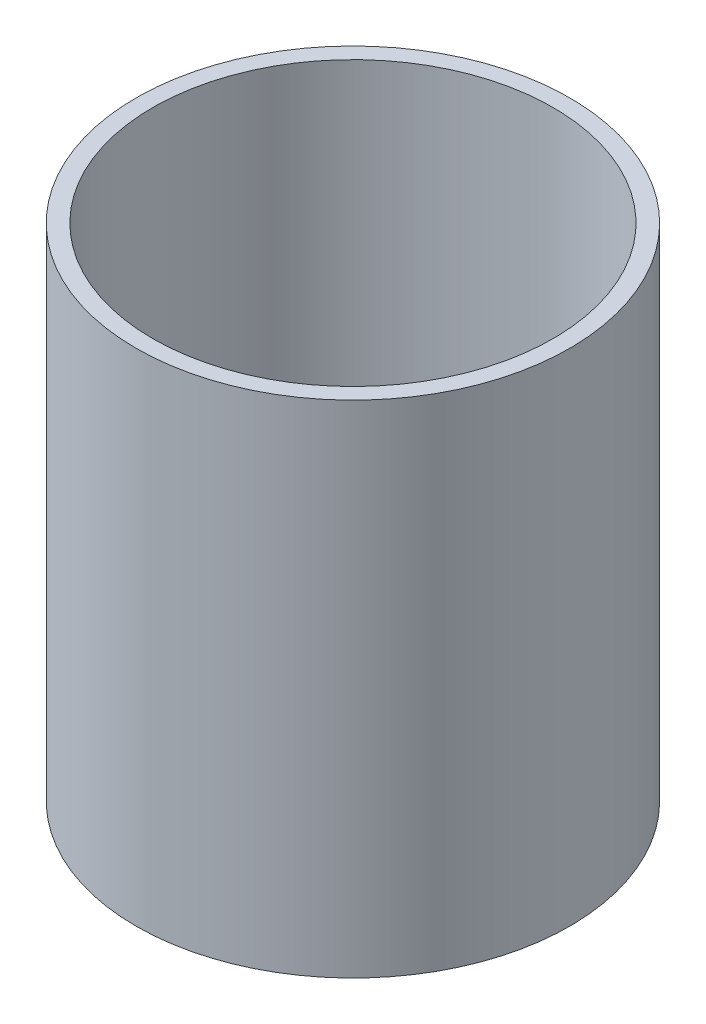
ISO-10303-21;
HEADER;
FILE_DESCRIPTION(('STEP AP214'),'2;1');
FILE_NAME('part.step','',(''),(''),'','','');
FILE_SCHEMA(('AUTOMOTIVE_DESIGN { 1 0 10303 214 1 1 1 1 }'));
ENDSEC;
DATA;
#1=APPLICATION_CONTEXT('core data for automotive mechanical design processes');
#2=APPLICATION_PROTOCOL_DEFINITION('international standard','automotive_design',2000,#1);
#3=PRODUCT_CONTEXT('',#1,'mechanical');
#4=PRODUCT('Part','Part','',(#3));
#5=PRODUCT_RELATED_PRODUCT_CATEGORY('part','',(#4));
#6=PRODUCT_DEFINITION_FORMATION('','',#4);
#7=PRODUCT_DEFINITION_CONTEXT('part definition',#1,'design');
#8=PRODUCT_DEFINITION('design','',#6,#7);
#9=PRODUCT_DEFINITION_SHAPE('','',#8);
#10=(LENGTH_UNIT() NAMED_UNIT(*) SI_UNIT(.MILLI.,.METRE.));
#11=(NAMED_UNIT(*) PLANE_ANGLE_UNIT() SI_UNIT($,.RADIAN.));
#12=(NAMED_UNIT(*) SI_UNIT($,.STERADIAN.) SOLID_ANGLE_UNIT());
#13=UNCERTAINTY_MEASURE_WITH_UNIT(LENGTH_MEASURE(1.E-05),#10,'distance_accuracy_value','');
#14=(GEOMETRIC_REPRESENTATION_CONTEXT(3) GLOBAL_UNCERTAINTY_ASSIGNED_CONTEXT((#13)) GLOBAL_UNIT_ASSIGNED_CONTEXT((#10,
#11,#12)) REPRESENTATION_CONTEXT('',''));
#15=CARTESIAN_POINT('',(0.,0.,0.));
#16=DIRECTION('',(0.,0.,1.));
#17=DIRECTION('',(1.,0.,0.));
#18=AXIS2_PLACEMENT_3D('',#15,#16,#17);
#19=CARTESIAN_POINT('',(0.,70.,0.));
#20=DIRECTION('',(0.,-1.,0.));
#21=DIRECTION('',(0.,0.,-1.));
#22=AXIS2_PLACEMENT_3D('',#19,#20,#21);
#23=CYLINDRICAL_SURFACE('',#22,26.);
#24=CARTESIAN_POINT('',(0.,0.,0.));
#25=DIRECTION('',(0.,1.,0.));
#26=DIRECTION('',(0.,0.,1.));
#27=AXIS2_PLACEMENT_3D('',#24,#25,#26);
#28=CIRCLE('',#27,26.);
#29=CARTESIAN_POINT('',(0.,0.,26.));
#30=VERTEX_POINT('',#29);
#31=EDGE_CURVE('E10',#30,#30,#28,.T.);
#32=ORIENTED_EDGE('',*,*,#31,.T.);
#33=EDGE_LOOP('',(#32));
#34=FACE_BOUND('',#33,.T.);
#35=CARTESIAN_POINT('',(0.,60.,0.));
#36=DIRECTION('',(0.,1.,0.));
#37=DIRECTION('',(0.,0.,1.));
#38=AXIS2_PLACEMENT_3D('',#35,#36,#37);
#39=CIRCLE('',#38,26.);
#40=CARTESIAN_POINT('',(0.,60.,26.));
#41=VERTEX_POINT('',#40);
#42=EDGE_CURVE('E45',#41,#41,#39,.T.);
#43=ORIENTED_EDGE('',*,*,#42,.F.);
#44=EDGE_LOOP('',(#43));
#45=FACE_BOUND('',#44,.T.);
#46=ADVANCED_FACE('F32',(#34,#45),#23,.T.);
#47=CARTESIAN_POINT('',(0.,70.,0.));
#48=DIRECTION('',(0.,-1.,0.));
#49=DIRECTION('',(0.,0.,-1.));
#50=AXIS2_PLACEMENT_3D('',#47,#48,#49);
#51=CYLINDRICAL_SURFACE('',#50,24.);
#52=CARTESIAN_POINT('',(0.,0.,0.));
#53=DIRECTION('',(0.,1.,0.));
#54=DIRECTION('',(0.,0.,1.));
#55=AXIS2_PLACEMENT_3D('',#52,#53,#54);
#56=CIRCLE('',#55,24.);
#57=CARTESIAN_POINT('',(0.,0.,24.));
#58=VERTEX_POINT('',#57);
#59=EDGE_CURVE('E39',#58,#58,#56,.T.);
#60=ORIENTED_EDGE('',*,*,#59,.F.);
#61=EDGE_LOOP('',(#60));
#62=FACE_BOUND('',#61,.T.);
#63=CARTESIAN_POINT('',(0.,60.,0.));
#64=DIRECTION('',(0.,1.,0.));
#65=DIRECTION('',(0.,0.,1.));
#66=AXIS2_PLACEMENT_3D('',#63,#64,#65);
#67=CIRCLE('',#66,24.);
#68=CARTESIAN_POINT('',(0.,60.,24.));
#69=VERTEX_POINT('',#68);
#70=EDGE_CURVE('E35',#69,#69,#67,.T.);
#71=ORIENTED_EDGE('',*,*,#70,.T.);
#72=EDGE_LOOP('',(#71));
#73=FACE_BOUND('',#72,.T.);
#74=ADVANCED_FACE('F52',(#62,#73),#51,.F.);
#75=CARTESIAN_POINT('',(0.,0.,0.));
#76=DIRECTION('',(0.,1.,0.));
#77=DIRECTION('',(0.,0.,1.));
#78=AXIS2_PLACEMENT_3D('',#75,#76,#77);
#79=PLANE('',#78);
#80=ORIENTED_EDGE('',*,*,#31,.F.);
#81=EDGE_LOOP('',(#80));
#82=FACE_BOUND('',#81,.T.);
#83=ORIENTED_EDGE('',*,*,#59,.T.);
#84=EDGE_LOOP('',(#83));
#85=FACE_BOUND('',#84,.T.);
#86=ADVANCED_FACE('F56',(#82,#85),#79,.F.);
#87=CARTESIAN_POINT('',(0.,60.,0.));
#88=DIRECTION('',(0.,1.,0.));
#89=DIRECTION('',(0.,0.,1.));
#90=AXIS2_PLACEMENT_3D('',#87,#88,#89);
#91=PLANE('',#90);
#92=ORIENTED_EDGE('',*,*,#70,.F.);
#93=EDGE_LOOP('',(#92));
#94=FACE_BOUND('',#93,.T.);
#95=ORIENTED_EDGE('',*,*,#42,.T.);
#96=EDGE_LOOP('',(#95));
#97=FACE_BOUND('',#96,.T.);
#98=ADVANCED_FACE('F54',(#94,#97),#91,.T.);
#99=CLOSED_SHELL('',(#46,#74,#86,#98));
#100=MANIFOLD_SOLID_BREP('B2',#99);
#101=ADVANCED_BREP_SHAPE_REPRESENTATION('',(#18,#100),#14);
#102=SHAPE_DEFINITION_REPRESENTATION(#9,#101);
ENDSEC;
END-ISO-10303-21;
